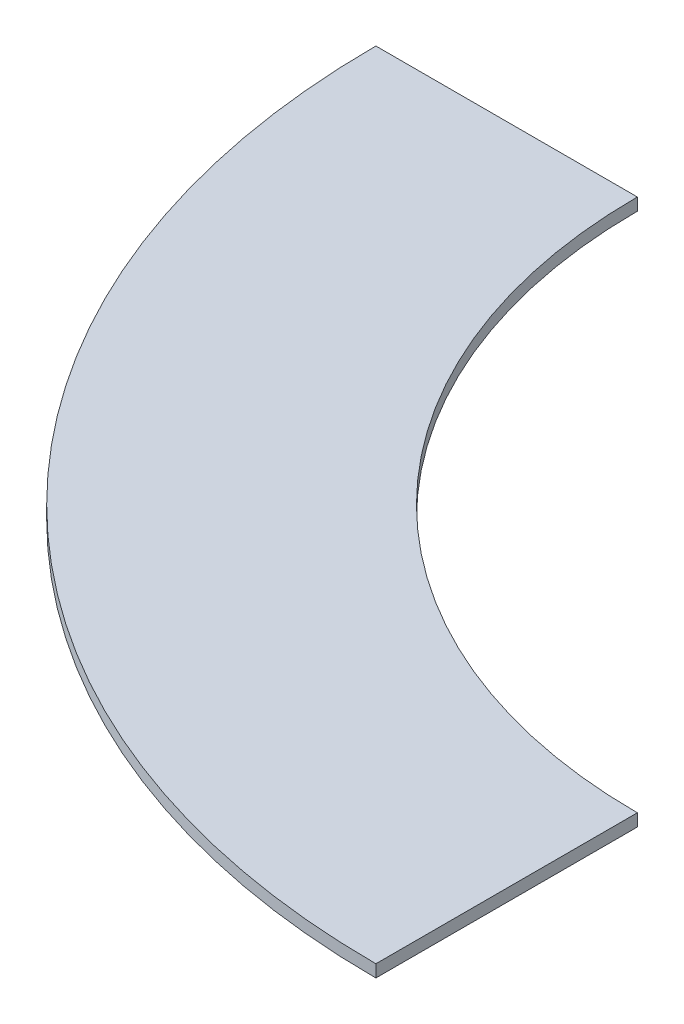
ISO-10303-21;
HEADER;
FILE_DESCRIPTION(('STEP AP214'),'2;1');
FILE_NAME('part.step','',(''),(''),'','','');
FILE_SCHEMA(('AUTOMOTIVE_DESIGN { 1 0 10303 214 1 1 1 1 }'));
ENDSEC;
DATA;
#1=APPLICATION_CONTEXT('core data for automotive mechanical design processes');
#2=APPLICATION_PROTOCOL_DEFINITION('international standard','automotive_design',2000,#1);
#3=PRODUCT_CONTEXT('',#1,'mechanical');
#4=PRODUCT('Part','Part','',(#3));
#5=PRODUCT_RELATED_PRODUCT_CATEGORY('part','',(#4));
#6=PRODUCT_DEFINITION_FORMATION('','',#4);
#7=PRODUCT_DEFINITION_CONTEXT('part definition',#1,'design');
#8=PRODUCT_DEFINITION('design','',#6,#7);
#9=PRODUCT_DEFINITION_SHAPE('','',#8);
#10=(LENGTH_UNIT() NAMED_UNIT(*) SI_UNIT(.MILLI.,.METRE.));
#11=(NAMED_UNIT(*) PLANE_ANGLE_UNIT() SI_UNIT($,.RADIAN.));
#12=(NAMED_UNIT(*) SI_UNIT($,.STERADIAN.) SOLID_ANGLE_UNIT());
#13=UNCERTAINTY_MEASURE_WITH_UNIT(LENGTH_MEASURE(1.E-05),#10,'distance_accuracy_value','');
#14=(GEOMETRIC_REPRESENTATION_CONTEXT(3) GLOBAL_UNCERTAINTY_ASSIGNED_CONTEXT((#13)) GLOBAL_UNIT_ASSIGNED_CONTEXT((#10,
#11,#12)) REPRESENTATION_CONTEXT('',''));
#15=CARTESIAN_POINT('',(0.,0.,0.));
#16=DIRECTION('',(0.,0.,1.));
#17=DIRECTION('',(1.,0.,0.));
#18=AXIS2_PLACEMENT_3D('',#15,#16,#17);
#19=CARTESIAN_POINT('',(0.,7.9375,0.));
#20=DIRECTION('',(0.,-1.,0.));
#21=DIRECTION('',(0.,0.,-1.));
#22=AXIS2_PLACEMENT_3D('',#19,#20,#21);
#23=CYLINDRICAL_SURFACE('',#22,342.9635);
#24=CARTESIAN_POINT('',(0.,0.,0.));
#25=DIRECTION('',(0.,1.,0.));
#26=DIRECTION('',(0.,0.,1.));
#27=AXIS2_PLACEMENT_3D('',#24,#25,#26);
#28=CIRCLE('',#27,342.9635);
#29=CARTESIAN_POINT('',(-342.9635,0.,0.));
#30=VERTEX_POINT('',#29);
#31=CARTESIAN_POINT('',(0.,0.,342.9635));
#32=VERTEX_POINT('',#31);
#33=EDGE_CURVE('E104',#30,#32,#28,.T.);
#34=ORIENTED_EDGE('',*,*,#33,.F.);
#35=DIRECTION('',(0.,-1.,0.));
#36=VECTOR('',#35,1.);
#37=CARTESIAN_POINT('',(-342.9635,7.9375,0.));
#38=LINE('',#37,#36);
#39=CARTESIAN_POINT('',(-342.9635,7.9375,0.));
#40=VERTEX_POINT('',#39);
#41=EDGE_CURVE('E11',#40,#30,#38,.T.);
#42=ORIENTED_EDGE('',*,*,#41,.F.);
#43=CARTESIAN_POINT('',(0.,7.9375,0.));
#44=DIRECTION('',(0.,1.,0.));
#45=DIRECTION('',(0.,0.,1.));
#46=AXIS2_PLACEMENT_3D('',#43,#44,#45);
#47=CIRCLE('',#46,342.9635);
#48=CARTESIAN_POINT('',(0.,7.9375,342.9635));
#49=VERTEX_POINT('',#48);
#50=EDGE_CURVE('E89',#40,#49,#47,.T.);
#51=ORIENTED_EDGE('',*,*,#50,.T.);
#52=DIRECTION('',(0.,-1.,0.));
#53=VECTOR('',#52,1.);
#54=CARTESIAN_POINT('',(0.,7.9375,342.9635));
#55=LINE('',#54,#53);
#56=EDGE_CURVE('E57',#49,#32,#55,.T.);
#57=ORIENTED_EDGE('',*,*,#56,.T.);
#58=EDGE_LOOP('',(#34,#42,#51,#57));
#59=FACE_BOUND('',#58,.T.);
#60=ADVANCED_FACE('F41',(#59),#23,.F.);
#61=CARTESIAN_POINT('',(0.,7.9375,0.));
#62=DIRECTION('',(0.,0.,1.));
#63=DIRECTION('',(1.,0.,0.));
#64=AXIS2_PLACEMENT_3D('',#61,#62,#63);
#65=PLANE('',#64);
#66=DIRECTION('',(-1.,0.,0.));
#67=VECTOR('',#66,1.);
#68=CARTESIAN_POINT('',(0.,0.,0.));
#69=LINE('',#68,#67);
#70=CARTESIAN_POINT('',(-511.1115,0.,0.));
#71=VERTEX_POINT('',#70);
#72=EDGE_CURVE('E95',#30,#71,#69,.T.);
#73=ORIENTED_EDGE('',*,*,#72,.T.);
#74=DIRECTION('',(0.,-1.,0.));
#75=VECTOR('',#74,1.);
#76=CARTESIAN_POINT('',(-511.1115,7.9375,0.));
#77=LINE('',#76,#75);
#78=CARTESIAN_POINT('',(-511.1115,7.9375,0.));
#79=VERTEX_POINT('',#78);
#80=EDGE_CURVE('E49',#79,#71,#77,.T.);
#81=ORIENTED_EDGE('',*,*,#80,.F.);
#82=DIRECTION('',(-1.,0.,0.));
#83=VECTOR('',#82,1.);
#84=CARTESIAN_POINT('',(0.,7.9375,0.));
#85=LINE('',#84,#83);
#86=EDGE_CURVE('E83',#40,#79,#85,.T.);
#87=ORIENTED_EDGE('',*,*,#86,.F.);
#88=ORIENTED_EDGE('',*,*,#41,.T.);
#89=EDGE_LOOP('',(#73,#81,#87,#88));
#90=FACE_BOUND('',#89,.T.);
#91=ADVANCED_FACE('F93',(#90),#65,.F.);
#92=CARTESIAN_POINT('',(0.,7.9375,0.));
#93=DIRECTION('',(0.,-1.,0.));
#94=DIRECTION('',(0.,0.,-1.));
#95=AXIS2_PLACEMENT_3D('',#92,#93,#94);
#96=CYLINDRICAL_SURFACE('',#95,511.1115);
#97=CARTESIAN_POINT('',(0.,0.,0.));
#98=DIRECTION('',(0.,1.,0.));
#99=DIRECTION('',(0.,0.,1.));
#100=AXIS2_PLACEMENT_3D('',#97,#98,#99);
#101=CIRCLE('',#100,511.1115);
#102=CARTESIAN_POINT('',(0.,0.,511.1115));
#103=VERTEX_POINT('',#102);
#104=EDGE_CURVE('E107',#71,#103,#101,.T.);
#105=ORIENTED_EDGE('',*,*,#104,.T.);
#106=DIRECTION('',(0.,-1.,0.));
#107=VECTOR('',#106,1.);
#108=CARTESIAN_POINT('',(0.,7.9375,511.1115));
#109=LINE('',#108,#107);
#110=CARTESIAN_POINT('',(0.,7.9375,511.1115));
#111=VERTEX_POINT('',#110);
#112=EDGE_CURVE('E71',#111,#103,#109,.T.);
#113=ORIENTED_EDGE('',*,*,#112,.F.);
#114=CARTESIAN_POINT('',(0.,7.9375,0.));
#115=DIRECTION('',(0.,1.,0.));
#116=DIRECTION('',(0.,0.,1.));
#117=AXIS2_PLACEMENT_3D('',#114,#115,#116);
#118=CIRCLE('',#117,511.1115);
#119=EDGE_CURVE('E88',#79,#111,#118,.T.);
#120=ORIENTED_EDGE('',*,*,#119,.F.);
#121=ORIENTED_EDGE('',*,*,#80,.T.);
#122=EDGE_LOOP('',(#105,#113,#120,#121));
#123=FACE_BOUND('',#122,.T.);
#124=ADVANCED_FACE('F98',(#123),#96,.T.);
#125=CARTESIAN_POINT('',(0.,7.9375,0.));
#126=DIRECTION('',(1.,0.,0.));
#127=DIRECTION('',(0.,0.,-1.));
#128=AXIS2_PLACEMENT_3D('',#125,#126,#127);
#129=PLANE('',#128);
#130=DIRECTION('',(0.,0.,1.));
#131=VECTOR('',#130,1.);
#132=CARTESIAN_POINT('',(0.,0.,0.));
#133=LINE('',#132,#131);
#134=EDGE_CURVE('E109',#32,#103,#133,.T.);
#135=ORIENTED_EDGE('',*,*,#134,.F.);
#136=ORIENTED_EDGE('',*,*,#56,.F.);
#137=DIRECTION('',(0.,0.,1.));
#138=VECTOR('',#137,1.);
#139=CARTESIAN_POINT('',(0.,7.9375,0.));
#140=LINE('',#139,#138);
#141=EDGE_CURVE('E99',#49,#111,#140,.T.);
#142=ORIENTED_EDGE('',*,*,#141,.T.);
#143=ORIENTED_EDGE('',*,*,#112,.T.);
#144=EDGE_LOOP('',(#135,#136,#142,#143));
#145=FACE_BOUND('',#144,.T.);
#146=ADVANCED_FACE('F114',(#145),#129,.T.);
#147=CARTESIAN_POINT('',(0.,7.9375,0.));
#148=DIRECTION('',(0.,1.,0.));
#149=DIRECTION('',(0.,0.,1.));
#150=AXIS2_PLACEMENT_3D('',#147,#148,#149);
#151=PLANE('',#150);
#152=ORIENTED_EDGE('',*,*,#50,.F.);
#153=ORIENTED_EDGE('',*,*,#86,.T.);
#154=ORIENTED_EDGE('',*,*,#119,.T.);
#155=ORIENTED_EDGE('',*,*,#141,.F.);
#156=EDGE_LOOP('',(#152,#153,#154,#155));
#157=FACE_BOUND('',#156,.T.);
#158=ADVANCED_FACE('F85',(#157),#151,.T.);
#159=CARTESIAN_POINT('',(0.,0.,0.));
#160=DIRECTION('',(0.,1.,0.));
#161=DIRECTION('',(0.,0.,1.));
#162=AXIS2_PLACEMENT_3D('',#159,#160,#161);
#163=PLANE('',#162);
#164=ORIENTED_EDGE('',*,*,#33,.T.);
#165=ORIENTED_EDGE('',*,*,#134,.T.);
#166=ORIENTED_EDGE('',*,*,#104,.F.);
#167=ORIENTED_EDGE('',*,*,#72,.F.);
#168=EDGE_LOOP('',(#164,#165,#166,#167));
#169=FACE_BOUND('',#168,.T.);
#170=ADVANCED_FACE('F121',(#169),#163,.F.);
#171=CLOSED_SHELL('',(#60,#91,#124,#146,#158,#170));
#172=MANIFOLD_SOLID_BREP('B2',#171);
#173=ADVANCED_BREP_SHAPE_REPRESENTATION('',(#18,#172),#14);
#174=SHAPE_DEFINITION_REPRESENTATION(#9,#173);
ENDSEC;
END-ISO-10303-21;
